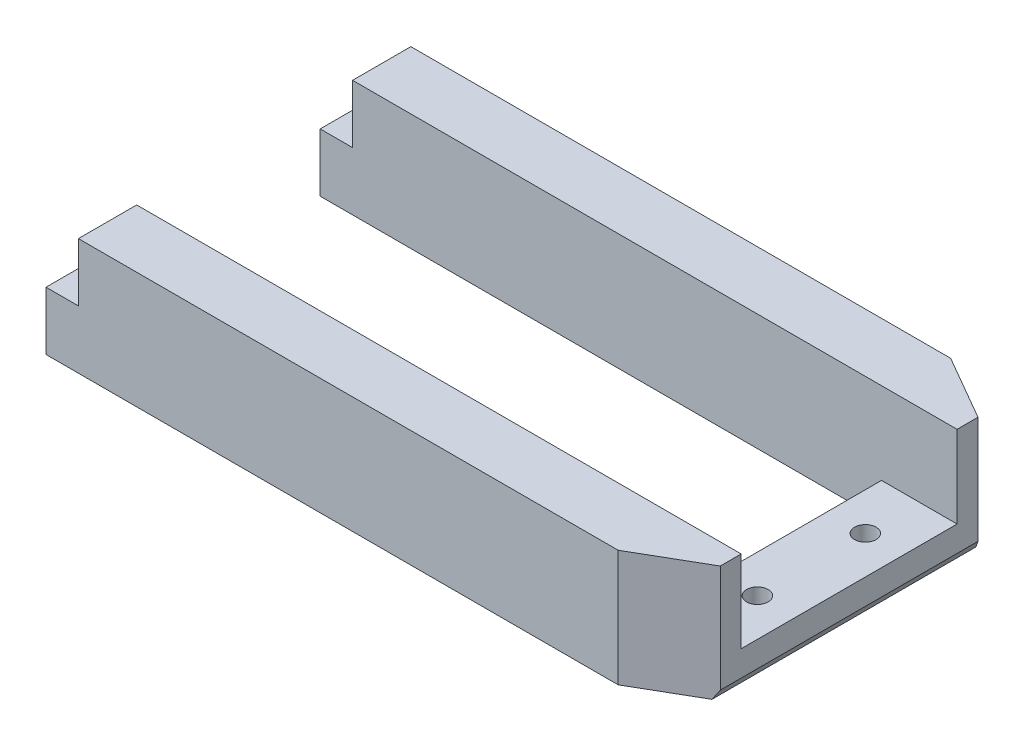
ISO-10303-21;
HEADER;
FILE_DESCRIPTION(('STEP AP214'),'2;1');
FILE_NAME('part.step','',(''),(''),'','','');
FILE_SCHEMA(('AUTOMOTIVE_DESIGN { 1 0 10303 214 1 1 1 1 }'));
ENDSEC;
DATA;
#1=APPLICATION_CONTEXT('core data for automotive mechanical design processes');
#2=APPLICATION_PROTOCOL_DEFINITION('international standard','automotive_design',2000,#1);
#3=PRODUCT_CONTEXT('',#1,'mechanical');
#4=PRODUCT('Part','Part','',(#3));
#5=PRODUCT_RELATED_PRODUCT_CATEGORY('part','',(#4));
#6=PRODUCT_DEFINITION_FORMATION('','',#4);
#7=PRODUCT_DEFINITION_CONTEXT('part definition',#1,'design');
#8=PRODUCT_DEFINITION('design','',#6,#7);
#9=PRODUCT_DEFINITION_SHAPE('','',#8);
#10=(LENGTH_UNIT() NAMED_UNIT(*) SI_UNIT(.MILLI.,.METRE.));
#11=(NAMED_UNIT(*) PLANE_ANGLE_UNIT() SI_UNIT($,.RADIAN.));
#12=(NAMED_UNIT(*) SI_UNIT($,.STERADIAN.) SOLID_ANGLE_UNIT());
#13=UNCERTAINTY_MEASURE_WITH_UNIT(LENGTH_MEASURE(1.E-05),#10,'distance_accuracy_value','');
#14=(GEOMETRIC_REPRESENTATION_CONTEXT(3) GLOBAL_UNCERTAINTY_ASSIGNED_CONTEXT((#13)) GLOBAL_UNIT_ASSIGNED_CONTEXT((#10,
#11,#12)) REPRESENTATION_CONTEXT('',''));
#15=CARTESIAN_POINT('',(0.,0.,0.));
#16=DIRECTION('',(0.,0.,1.));
#17=DIRECTION('',(1.,0.,0.));
#18=AXIS2_PLACEMENT_3D('',#15,#16,#17);
#19=CARTESIAN_POINT('',(-29.0045380195893,13.,-10.8670584657187));
#20=DIRECTION('',(1.,0.,0.));
#21=DIRECTION('',(0.,0.,-1.));
#22=AXIS2_PLACEMENT_3D('',#19,#20,#21);
#23=PLANE('',#22);
#24=DIRECTION('',(0.,-1.,0.));
#25=VECTOR('',#24,1.);
#26=CARTESIAN_POINT('',(-29.0045380195893,13.,-16.2670580842487));
#27=LINE('',#26,#25);
#28=CARTESIAN_POINT('',(-29.0045380195893,7.6,-16.2670580842487));
#29=VERTEX_POINT('',#28);
#30=CARTESIAN_POINT('',(-29.0045380195893,2.2,-16.2670580842487));
#31=VERTEX_POINT('',#30);
#32=EDGE_CURVE('E173',#29,#31,#27,.T.);
#33=ORIENTED_EDGE('',*,*,#32,.T.);
#34=DIRECTION('',(0.,0.,-1.));
#35=VECTOR('',#34,1.);
#36=CARTESIAN_POINT('',(-29.0045380195893,2.2,18.7329419157513));
#37=LINE('',#36,#35);
#38=CARTESIAN_POINT('',(-29.0045380195893,2.2,-10.8670584657187));
#39=VERTEX_POINT('',#38);
#40=EDGE_CURVE('E156',#39,#31,#37,.T.);
#41=ORIENTED_EDGE('',*,*,#40,.F.);
#42=DIRECTION('',(0.,-1.,0.));
#43=VECTOR('',#42,1.);
#44=CARTESIAN_POINT('',(-29.0045380195893,13.,-10.8670584657187));
#45=LINE('',#44,#43);
#46=CARTESIAN_POINT('',(-29.0045380195893,7.6,-10.8670584657187));
#47=VERTEX_POINT('',#46);
#48=EDGE_CURVE('E178',#47,#39,#45,.T.);
#49=ORIENTED_EDGE('',*,*,#48,.F.);
#50=DIRECTION('',(0.,0.,1.));
#51=VECTOR('',#50,1.);
#52=CARTESIAN_POINT('',(-29.0045380195893,7.6,-16.2670580842487));
#53=LINE('',#52,#51);
#54=EDGE_CURVE('E61',#29,#47,#53,.T.);
#55=ORIENTED_EDGE('',*,*,#54,.F.);
#56=EDGE_LOOP('',(#33,#41,#49,#55));
#57=FACE_BOUND('',#56,.T.);
#58=ADVANCED_FACE('F39',(#57),#23,.F.);
#59=CARTESIAN_POINT('',(-29.0045380195893,13.,14.5329411528113));
#60=DIRECTION('',(1.,0.,0.));
#61=DIRECTION('',(0.,0.,-1.));
#62=AXIS2_PLACEMENT_3D('',#59,#60,#61);
#63=PLANE('',#62);
#64=DIRECTION('',(0.,-1.,0.));
#65=VECTOR('',#64,1.);
#66=CARTESIAN_POINT('',(-29.0045380195893,13.,9.13294153428132));
#67=LINE('',#66,#65);
#68=CARTESIAN_POINT('',(-29.0045380195893,7.6,9.13294153428132));
#69=VERTEX_POINT('',#68);
#70=CARTESIAN_POINT('',(-29.0045380195893,2.2,9.13294153428132));
#71=VERTEX_POINT('',#70);
#72=EDGE_CURVE('E307',#69,#71,#67,.T.);
#73=ORIENTED_EDGE('',*,*,#72,.T.);
#74=CARTESIAN_POINT('',(-29.0045380195893,2.2,14.5329411528113));
#75=VERTEX_POINT('',#74);
#76=EDGE_CURVE('E166',#75,#71,#37,.T.);
#77=ORIENTED_EDGE('',*,*,#76,.F.);
#78=DIRECTION('',(0.,-1.,0.));
#79=VECTOR('',#78,1.);
#80=CARTESIAN_POINT('',(-29.0045380195893,13.,14.5329411528113));
#81=LINE('',#80,#79);
#82=CARTESIAN_POINT('',(-29.0045380195893,7.6,14.5329411528113));
#83=VERTEX_POINT('',#82);
#84=EDGE_CURVE('E209',#83,#75,#81,.T.);
#85=ORIENTED_EDGE('',*,*,#84,.F.);
#86=DIRECTION('',(0.,0.,1.));
#87=VECTOR('',#86,1.);
#88=CARTESIAN_POINT('',(-29.0045380195893,7.6,9.13294153428132));
#89=LINE('',#88,#87);
#90=EDGE_CURVE('E260',#69,#83,#89,.T.);
#91=ORIENTED_EDGE('',*,*,#90,.F.);
#92=EDGE_LOOP('',(#73,#77,#85,#91));
#93=FACE_BOUND('',#92,.T.);
#94=ADVANCED_FACE('F340',(#93),#63,.F.);
#95=CARTESIAN_POINT('',(22.9954619804107,13.,9.13294153428132));
#96=DIRECTION('',(1.,0.,0.));
#97=DIRECTION('',(0.,0.,-1.));
#98=AXIS2_PLACEMENT_3D('',#95,#96,#97);
#99=PLANE('',#98);
#100=DIRECTION('',(0.,-1.,0.));
#101=VECTOR('',#100,1.);
#102=CARTESIAN_POINT('',(22.9954619804107,13.,-10.8670584657187));
#103=LINE('',#102,#101);
#104=CARTESIAN_POINT('',(22.9954619804107,5.4,-10.8670584657187));
#105=VERTEX_POINT('',#104);
#106=CARTESIAN_POINT('',(22.9954619804107,2.19999999999999,-10.8670584657187));
#107=VERTEX_POINT('',#106);
#108=EDGE_CURVE('E182',#105,#107,#103,.T.);
#109=ORIENTED_EDGE('',*,*,#108,.T.);
#110=DIRECTION('',(0.,0.,1.));
#111=VECTOR('',#110,1.);
#112=CARTESIAN_POINT('',(22.9954619804107,2.19999999999999,9.13294153428132));
#113=LINE('',#112,#111);
#114=CARTESIAN_POINT('',(22.9954619804107,2.19999999999999,9.13294153428132));
#115=VERTEX_POINT('',#114);
#116=EDGE_CURVE('E224',#107,#115,#113,.T.);
#117=ORIENTED_EDGE('',*,*,#116,.T.);
#118=DIRECTION('',(0.,-1.,0.));
#119=VECTOR('',#118,1.);
#120=CARTESIAN_POINT('',(22.9954619804107,13.,9.13294153428132));
#121=LINE('',#120,#119);
#122=CARTESIAN_POINT('',(22.9954619804107,5.4,9.13294153428132));
#123=VERTEX_POINT('',#122);
#124=EDGE_CURVE('E310',#123,#115,#121,.T.);
#125=ORIENTED_EDGE('',*,*,#124,.F.);
#126=DIRECTION('',(0.,0.,1.));
#127=VECTOR('',#126,1.);
#128=CARTESIAN_POINT('',(22.9954619804107,5.4,-10.8670584657187));
#129=LINE('',#128,#127);
#130=EDGE_CURVE('E258',#105,#123,#129,.T.);
#131=ORIENTED_EDGE('',*,*,#130,.F.);
#132=EDGE_LOOP('',(#109,#117,#125,#131));
#133=FACE_BOUND('',#132,.T.);
#134=ADVANCED_FACE('F316',(#133),#99,.F.);
#135=CARTESIAN_POINT('',(0.,13.,0.));
#136=DIRECTION('',(0.,-1.,0.));
#137=DIRECTION('',(0.,0.,-1.));
#138=AXIS2_PLACEMENT_3D('',#135,#136,#137);
#139=PLANE('',#138);
#140=DIRECTION('',(-1.,0.,0.));
#141=VECTOR('',#140,1.);
#142=CARTESIAN_POINT('',(-29.0045380195893,13.,-16.2670580842487));
#143=LINE('',#142,#141);
#144=CARTESIAN_POINT('',(23.9987941184727,13.,-16.2670580842487));
#145=VERTEX_POINT('',#144);
#146=CARTESIAN_POINT('',(-26.0045380195893,13.,-16.2670580842487));
#147=VERTEX_POINT('',#146);
#148=EDGE_CURVE('E298',#145,#147,#143,.T.);
#149=ORIENTED_EDGE('',*,*,#148,.T.);
#150=DIRECTION('',(0.,0.,-1.));
#151=VECTOR('',#150,1.);
#152=CARTESIAN_POINT('',(-26.0045380195893,13.,-16.2670580842487));
#153=LINE('',#152,#151);
#154=CARTESIAN_POINT('',(-26.0045380195893,13.,-10.8670584657187));
#155=VERTEX_POINT('',#154);
#156=EDGE_CURVE('E245',#155,#147,#153,.T.);
#157=ORIENTED_EDGE('',*,*,#156,.F.);
#158=DIRECTION('',(1.,0.,0.));
#159=VECTOR('',#158,1.);
#160=CARTESIAN_POINT('',(22.9954619804107,13.,-10.8670584657187));
#161=LINE('',#160,#159);
#162=CARTESIAN_POINT('',(29.9954619804107,13.,-10.8670584657187));
#163=VERTEX_POINT('',#162);
#164=EDGE_CURVE('E301',#155,#163,#161,.T.);
#165=ORIENTED_EDGE('',*,*,#164,.T.);
#166=DIRECTION('',(0.,0.,-1.));
#167=VECTOR('',#166,1.);
#168=CARTESIAN_POINT('',(29.9954619804107,13.,-12.8048808076377));
#169=LINE('',#168,#167);
#170=CARTESIAN_POINT('',(29.9954619804107,13.,-12.8048808076377));
#171=VERTEX_POINT('',#170);
#172=EDGE_CURVE('E292',#163,#171,#169,.T.);
#173=ORIENTED_EDGE('',*,*,#172,.T.);
#174=DIRECTION('',(-0.866025436785245,0.,-0.499999942840922));
#175=VECTOR('',#174,1.);
#176=CARTESIAN_POINT('',(23.9987941184727,13.,-16.2670580842487));
#177=LINE('',#176,#175);
#178=EDGE_CURVE('E296',#171,#145,#177,.T.);
#179=ORIENTED_EDGE('',*,*,#178,.T.);
#180=EDGE_LOOP('',(#149,#157,#165,#173,#179));
#181=FACE_BOUND('',#180,.T.);
#182=ADVANCED_FACE('F328',(#181),#139,.F.);
#183=CARTESIAN_POINT('',(23.9987941184727,13.,14.5329411528113));
#184=DIRECTION('',(0.,0.,-1.));
#185=DIRECTION('',(-1.,0.,0.));
#186=AXIS2_PLACEMENT_3D('',#183,#184,#185);
#187=PLANE('',#186);
#188=ORIENTED_EDGE('',*,*,#84,.T.);
#189=DIRECTION('',(1.,0.,0.));
#190=VECTOR('',#189,1.);
#191=CARTESIAN_POINT('',(23.9987941184727,2.19999999999999,14.5329411528113));
#192=LINE('',#191,#190);
#193=CARTESIAN_POINT('',(23.9987941184727,2.19999999999999,14.5329411528113));
#194=VERTEX_POINT('',#193);
#195=EDGE_CURVE('E206',#75,#194,#192,.T.);
#196=ORIENTED_EDGE('',*,*,#195,.T.);
#197=DIRECTION('',(0.,-1.,0.));
#198=VECTOR('',#197,1.);
#199=CARTESIAN_POINT('',(23.9987941184727,13.,14.5329411528113));
#200=LINE('',#199,#198);
#201=CARTESIAN_POINT('',(23.9987941184727,13.,14.5329411528113));
#202=VERTEX_POINT('',#201);
#203=EDGE_CURVE('E47',#202,#194,#200,.T.);
#204=ORIENTED_EDGE('',*,*,#203,.F.);
#205=DIRECTION('',(1.,0.,0.));
#206=VECTOR('',#205,1.);
#207=CARTESIAN_POINT('',(23.9987941184727,13.,14.5329411528113));
#208=LINE('',#207,#206);
#209=CARTESIAN_POINT('',(-26.0045380195893,13.,14.5329411528113));
#210=VERTEX_POINT('',#209);
#211=EDGE_CURVE('E205',#210,#202,#208,.T.);
#212=ORIENTED_EDGE('',*,*,#211,.F.);
#213=DIRECTION('',(0.,1.,0.));
#214=VECTOR('',#213,1.);
#215=CARTESIAN_POINT('',(-26.0045380195893,7.6,14.5329411528113));
#216=LINE('',#215,#214);
#217=CARTESIAN_POINT('',(-26.0045380195893,7.6,14.5329411528113));
#218=VERTEX_POINT('',#217);
#219=EDGE_CURVE('E270',#218,#210,#216,.T.);
#220=ORIENTED_EDGE('',*,*,#219,.F.);
#221=DIRECTION('',(1.,0.,0.));
#222=VECTOR('',#221,1.);
#223=CARTESIAN_POINT('',(-29.0045380195893,7.6,14.5329411528113));
#224=LINE('',#223,#222);
#225=EDGE_CURVE('E262',#83,#218,#224,.T.);
#226=ORIENTED_EDGE('',*,*,#225,.F.);
#227=EDGE_LOOP('',(#188,#196,#204,#212,#220,#226));
#228=FACE_BOUND('',#227,.T.);
#229=ADVANCED_FACE('F41',(#228),#187,.F.);
#230=CARTESIAN_POINT('',(29.9954619804107,13.,11.0707638761913));
#231=DIRECTION('',(-0.499999942841897,0.,-0.866025436784682));
#232=DIRECTION('',(-0.866025436784682,0.,0.499999942841897));
#233=AXIS2_PLACEMENT_3D('',#230,#231,#232);
#234=PLANE('',#233);
#235=ORIENTED_EDGE('',*,*,#203,.T.);
#236=DIRECTION('',(0.866025436784682,0.,-0.499999942841897));
#237=VECTOR('',#236,1.);
#238=CARTESIAN_POINT('',(29.9954619804107,2.19999999999999,11.0707638761913));
#239=LINE('',#238,#237);
#240=CARTESIAN_POINT('',(29.509146190937,2.19999999999999,11.351538385359));
#241=VERTEX_POINT('',#240);
#242=EDGE_CURVE('E196',#194,#241,#239,.T.);
#243=ORIENTED_EDGE('',*,*,#242,.T.);
#244=DIRECTION('',(0.481303277855296,0.831342025386419,-0.277880534676602));
#245=VECTOR('',#244,1.);
#246=CARTESIAN_POINT('',(33.9807332931106,9.92365044920899,8.76986676171679));
#247=LINE('',#246,#245);
#248=CARTESIAN_POINT('',(29.9954619804107,3.04,11.0707638761913));
#249=VERTEX_POINT('',#248);
#250=EDGE_CURVE('E234',#241,#249,#247,.T.);
#251=ORIENTED_EDGE('',*,*,#250,.T.);
#252=DIRECTION('',(0.,-1.,0.));
#253=VECTOR('',#252,1.);
#254=CARTESIAN_POINT('',(29.9954619804107,13.,11.0707638761913));
#255=LINE('',#254,#253);
#256=CARTESIAN_POINT('',(29.9954619804107,13.,11.0707638761913));
#257=VERTEX_POINT('',#256);
#258=EDGE_CURVE('E188',#257,#249,#255,.T.);
#259=ORIENTED_EDGE('',*,*,#258,.F.);
#260=DIRECTION('',(0.866025436784683,0.,-0.499999942841897));
#261=VECTOR('',#260,1.);
#262=CARTESIAN_POINT('',(29.9954619804107,13.,11.0707638761913));
#263=LINE('',#262,#261);
#264=EDGE_CURVE('E199',#202,#257,#263,.T.);
#265=ORIENTED_EDGE('',*,*,#264,.F.);
#266=EDGE_LOOP('',(#235,#243,#251,#259,#265));
#267=FACE_BOUND('',#266,.T.);
#268=ADVANCED_FACE('F195',(#267),#234,.F.);
#269=CARTESIAN_POINT('',(29.9954619804107,13.,-12.8048808076377));
#270=DIRECTION('',(-1.,0.,0.));
#271=DIRECTION('',(0.,0.,1.));
#272=AXIS2_PLACEMENT_3D('',#269,#270,#271);
#273=PLANE('',#272);
#274=ORIENTED_EDGE('',*,*,#258,.T.);
#275=DIRECTION('',(0.,0.,1.));
#276=VECTOR('',#275,1.);
#277=CARTESIAN_POINT('',(29.9954619804107,3.04,-17.8670588471887));
#278=LINE('',#277,#276);
#279=CARTESIAN_POINT('',(29.9954619804107,3.04,-12.8048808076377));
#280=VERTEX_POINT('',#279);
#281=EDGE_CURVE('E228',#280,#249,#278,.T.);
#282=ORIENTED_EDGE('',*,*,#281,.F.);
#283=DIRECTION('',(0.,-1.,0.));
#284=VECTOR('',#283,1.);
#285=CARTESIAN_POINT('',(29.9954619804107,13.,-12.8048808076377));
#286=LINE('',#285,#284);
#287=EDGE_CURVE('E180',#171,#280,#286,.T.);
#288=ORIENTED_EDGE('',*,*,#287,.F.);
#289=ORIENTED_EDGE('',*,*,#172,.F.);
#290=DIRECTION('',(0.,1.,0.));
#291=VECTOR('',#290,1.);
#292=CARTESIAN_POINT('',(29.9954619804107,5.4,-10.8670584657187));
#293=LINE('',#292,#291);
#294=CARTESIAN_POINT('',(29.9954619804107,5.4,-10.8670584657187));
#295=VERTEX_POINT('',#294);
#296=EDGE_CURVE('E285',#295,#163,#293,.T.);
#297=ORIENTED_EDGE('',*,*,#296,.F.);
#298=DIRECTION('',(0.,0.,-1.));
#299=VECTOR('',#298,1.);
#300=CARTESIAN_POINT('',(29.9954619804107,5.4,-10.8670584657187));
#301=LINE('',#300,#299);
#302=CARTESIAN_POINT('',(29.9954619804107,5.4,9.13294153428132));
#303=VERTEX_POINT('',#302);
#304=EDGE_CURVE('E280',#303,#295,#301,.T.);
#305=ORIENTED_EDGE('',*,*,#304,.F.);
#306=DIRECTION('',(0.,1.,0.));
#307=VECTOR('',#306,1.);
#308=CARTESIAN_POINT('',(29.9954619804107,5.4,9.13294153428132));
#309=LINE('',#308,#307);
#310=CARTESIAN_POINT('',(29.9954619804107,13.,9.13294153428132));
#311=VERTEX_POINT('',#310);
#312=EDGE_CURVE('E284',#303,#311,#309,.T.);
#313=ORIENTED_EDGE('',*,*,#312,.T.);
#314=EDGE_CURVE('E293',#257,#311,#169,.T.);
#315=ORIENTED_EDGE('',*,*,#314,.F.);
#316=EDGE_LOOP('',(#274,#282,#288,#289,#297,#305,#313,#315));
#317=FACE_BOUND('',#316,.T.);
#318=ADVANCED_FACE('F351',(#317),#273,.F.);
#319=CARTESIAN_POINT('',(23.9987941184727,13.,-16.2670580842487));
#320=DIRECTION('',(-0.499999942840922,0.,0.866025436785245));
#321=DIRECTION('',(0.866025436785245,0.,0.499999942840922));
#322=AXIS2_PLACEMENT_3D('',#319,#320,#321);
#323=PLANE('',#322);
#324=DIRECTION('',(-0.481303277855392,-0.831342025386586,-0.277880534675935));
#325=VECTOR('',#324,1.);
#326=CARTESIAN_POINT('',(32.1285398710942,6.72440726572613,-11.5733479009645));
#327=LINE('',#326,#325);
#328=CARTESIAN_POINT('',(29.509146190937,2.19999999999999,-13.0856553168046));
#329=VERTEX_POINT('',#328);
#330=EDGE_CURVE('E231',#280,#329,#327,.T.);
#331=ORIENTED_EDGE('',*,*,#330,.T.);
#332=DIRECTION('',(-0.866025436785245,0.,-0.499999942840922));
#333=VECTOR('',#332,1.);
#334=CARTESIAN_POINT('',(23.9987941184727,2.19999999999999,-16.2670580842487));
#335=LINE('',#334,#333);
#336=CARTESIAN_POINT('',(23.9987941184727,2.19999999999999,-16.2670580842487));
#337=VERTEX_POINT('',#336);
#338=EDGE_CURVE('E54',#329,#337,#335,.T.);
#339=ORIENTED_EDGE('',*,*,#338,.T.);
#340=DIRECTION('',(0.,-1.,0.));
#341=VECTOR('',#340,1.);
#342=CARTESIAN_POINT('',(23.9987941184727,13.,-16.2670580842487));
#343=LINE('',#342,#341);
#344=EDGE_CURVE('E176',#145,#337,#343,.T.);
#345=ORIENTED_EDGE('',*,*,#344,.F.);
#346=ORIENTED_EDGE('',*,*,#178,.F.);
#347=ORIENTED_EDGE('',*,*,#287,.T.);
#348=EDGE_LOOP('',(#331,#339,#345,#346,#347));
#349=FACE_BOUND('',#348,.T.);
#350=ADVANCED_FACE('F333',(#349),#323,.F.);
#351=CARTESIAN_POINT('',(-29.0045380195893,13.,-16.2670580842487));
#352=DIRECTION('',(0.,0.,1.));
#353=DIRECTION('',(1.,0.,0.));
#354=AXIS2_PLACEMENT_3D('',#351,#352,#353);
#355=PLANE('',#354);
#356=ORIENTED_EDGE('',*,*,#344,.T.);
#357=DIRECTION('',(1.,0.,0.));
#358=VECTOR('',#357,1.);
#359=CARTESIAN_POINT('',(-29.0045380195893,2.2,-16.2670580842487));
#360=LINE('',#359,#358);
#361=EDGE_CURVE('E159',#31,#337,#360,.T.);
#362=ORIENTED_EDGE('',*,*,#361,.F.);
#363=ORIENTED_EDGE('',*,*,#32,.F.);
#364=DIRECTION('',(-1.,0.,0.));
#365=VECTOR('',#364,1.);
#366=CARTESIAN_POINT('',(-29.0045380195893,7.6,-16.2670580842487));
#367=LINE('',#366,#365);
#368=CARTESIAN_POINT('',(-26.0045380195893,7.6,-16.2670580842487));
#369=VERTEX_POINT('',#368);
#370=EDGE_CURVE('E250',#369,#29,#367,.T.);
#371=ORIENTED_EDGE('',*,*,#370,.F.);
#372=DIRECTION('',(0.,1.,0.));
#373=VECTOR('',#372,1.);
#374=CARTESIAN_POINT('',(-26.0045380195893,7.6,-16.2670580842487));
#375=LINE('',#374,#373);
#376=EDGE_CURVE('E255',#369,#147,#375,.T.);
#377=ORIENTED_EDGE('',*,*,#376,.T.);
#378=ORIENTED_EDGE('',*,*,#148,.F.);
#379=EDGE_LOOP('',(#356,#362,#363,#371,#377,#378));
#380=FACE_BOUND('',#379,.T.);
#381=ADVANCED_FACE('F171',(#380),#355,.F.);
#382=CARTESIAN_POINT('',(22.9954619804107,13.,-10.8670584657187));
#383=DIRECTION('',(0.,0.,-1.));
#384=DIRECTION('',(-1.,0.,0.));
#385=AXIS2_PLACEMENT_3D('',#382,#383,#384);
#386=PLANE('',#385);
#387=ORIENTED_EDGE('',*,*,#48,.T.);
#388=DIRECTION('',(1.,0.,0.));
#389=VECTOR('',#388,1.);
#390=CARTESIAN_POINT('',(22.9954619804107,2.19999999999999,-10.8670584657187));
#391=LINE('',#390,#389);
#392=EDGE_CURVE('E161',#39,#107,#391,.T.);
#393=ORIENTED_EDGE('',*,*,#392,.T.);
#394=ORIENTED_EDGE('',*,*,#108,.F.);
#395=DIRECTION('',(-1.,0.,0.));
#396=VECTOR('',#395,1.);
#397=CARTESIAN_POINT('',(22.9954619804107,5.4,-10.8670584657187));
#398=LINE('',#397,#396);
#399=EDGE_CURVE('E282',#295,#105,#398,.T.);
#400=ORIENTED_EDGE('',*,*,#399,.F.);
#401=ORIENTED_EDGE('',*,*,#296,.T.);
#402=ORIENTED_EDGE('',*,*,#164,.F.);
#403=DIRECTION('',(0.,1.,0.));
#404=VECTOR('',#403,1.);
#405=CARTESIAN_POINT('',(-26.0045380195893,7.6,-10.8670584657187));
#406=LINE('',#405,#404);
#407=CARTESIAN_POINT('',(-26.0045380195893,7.6,-10.8670584657187));
#408=VERTEX_POINT('',#407);
#409=EDGE_CURVE('E252',#408,#155,#406,.T.);
#410=ORIENTED_EDGE('',*,*,#409,.F.);
#411=DIRECTION('',(1.,0.,0.));
#412=VECTOR('',#411,1.);
#413=CARTESIAN_POINT('',(-29.0045380195893,7.6,-10.8670584657187));
#414=LINE('',#413,#412);
#415=EDGE_CURVE('E244',#47,#408,#414,.T.);
#416=ORIENTED_EDGE('',*,*,#415,.F.);
#417=EDGE_LOOP('',(#387,#393,#394,#400,#401,#402,#410,#416));
#418=FACE_BOUND('',#417,.T.);
#419=ADVANCED_FACE('F320',(#418),#386,.F.);
#420=CARTESIAN_POINT('',(-29.0045380195893,13.,9.13294153428132));
#421=DIRECTION('',(0.,0.,1.));
#422=DIRECTION('',(1.,0.,0.));
#423=AXIS2_PLACEMENT_3D('',#420,#421,#422);
#424=PLANE('',#423);
#425=ORIENTED_EDGE('',*,*,#124,.T.);
#426=DIRECTION('',(-1.,0.,0.));
#427=VECTOR('',#426,1.);
#428=CARTESIAN_POINT('',(-29.0045380195893,2.2,9.13294153428132));
#429=LINE('',#428,#427);
#430=EDGE_CURVE('E221',#115,#71,#429,.T.);
#431=ORIENTED_EDGE('',*,*,#430,.T.);
#432=ORIENTED_EDGE('',*,*,#72,.F.);
#433=DIRECTION('',(-1.,0.,0.));
#434=VECTOR('',#433,1.);
#435=CARTESIAN_POINT('',(-29.0045380195893,7.6,9.13294153428132));
#436=LINE('',#435,#434);
#437=CARTESIAN_POINT('',(-26.0045380195893,7.6,9.13294153428132));
#438=VERTEX_POINT('',#437);
#439=EDGE_CURVE('E268',#438,#69,#436,.T.);
#440=ORIENTED_EDGE('',*,*,#439,.F.);
#441=DIRECTION('',(0.,1.,0.));
#442=VECTOR('',#441,1.);
#443=CARTESIAN_POINT('',(-26.0045380195893,7.6,9.13294153428132));
#444=LINE('',#443,#442);
#445=CARTESIAN_POINT('',(-26.0045380195893,13.,9.13294153428132));
#446=VERTEX_POINT('',#445);
#447=EDGE_CURVE('E254',#438,#446,#444,.T.);
#448=ORIENTED_EDGE('',*,*,#447,.T.);
#449=DIRECTION('',(-1.,0.,0.));
#450=VECTOR('',#449,1.);
#451=CARTESIAN_POINT('',(-29.0045380195893,13.,9.13294153428132));
#452=LINE('',#451,#450);
#453=EDGE_CURVE('E303',#311,#446,#452,.T.);
#454=ORIENTED_EDGE('',*,*,#453,.F.);
#455=ORIENTED_EDGE('',*,*,#312,.F.);
#456=DIRECTION('',(1.,0.,0.));
#457=VECTOR('',#456,1.);
#458=CARTESIAN_POINT('',(22.9954619804107,5.4,9.13294153428132));
#459=LINE('',#458,#457);
#460=EDGE_CURVE('E277',#123,#303,#459,.T.);
#461=ORIENTED_EDGE('',*,*,#460,.F.);
#462=EDGE_LOOP('',(#425,#431,#432,#440,#448,#454,#455,#461));
#463=FACE_BOUND('',#462,.T.);
#464=ADVANCED_FACE('F337',(#463),#424,.F.);
#465=ORIENTED_EDGE('',*,*,#453,.T.);
#466=DIRECTION('',(0.,0.,-1.));
#467=VECTOR('',#466,1.);
#468=CARTESIAN_POINT('',(-26.0045380195893,13.,9.13294153428132));
#469=LINE('',#468,#467);
#470=EDGE_CURVE('E240',#210,#446,#469,.T.);
#471=ORIENTED_EDGE('',*,*,#470,.F.);
#472=ORIENTED_EDGE('',*,*,#211,.T.);
#473=ORIENTED_EDGE('',*,*,#264,.T.);
#474=ORIENTED_EDGE('',*,*,#314,.T.);
#475=EDGE_LOOP('',(#465,#471,#472,#473,#474));
#476=FACE_BOUND('',#475,.T.);
#477=ADVANCED_FACE('F347',(#476),#139,.F.);
#478=CARTESIAN_POINT('',(0.,5.4,0.));
#479=DIRECTION('',(0.,1.,0.));
#480=DIRECTION('',(0.,0.,1.));
#481=AXIS2_PLACEMENT_3D('',#478,#479,#480);
#482=PLANE('',#481);
#483=CARTESIAN_POINT('',(26.4954619804107,5.4,-5.86705846571868));
#484=DIRECTION('',(0.,1.,0.));
#485=DIRECTION('',(0.,0.,1.));
#486=AXIS2_PLACEMENT_3D('',#483,#484,#485);
#487=CIRCLE('',#486,1.);
#488=CARTESIAN_POINT('',(26.4954619804107,5.4,-4.86705846571867));
#489=VERTEX_POINT('',#488);
#490=EDGE_CURVE('E237',#489,#489,#487,.T.);
#491=ORIENTED_EDGE('',*,*,#490,.F.);
#492=EDGE_LOOP('',(#491));
#493=FACE_BOUND('',#492,.T.);
#494=CARTESIAN_POINT('',(26.4954619804107,5.4,4.13294153428132));
#495=DIRECTION('',(0.,1.,0.));
#496=DIRECTION('',(0.,0.,1.));
#497=AXIS2_PLACEMENT_3D('',#494,#495,#496);
#498=CIRCLE('',#497,1.);
#499=CARTESIAN_POINT('',(26.4954619804107,5.4,5.13294153428132));
#500=VERTEX_POINT('',#499);
#501=EDGE_CURVE('E236',#500,#500,#498,.T.);
#502=ORIENTED_EDGE('',*,*,#501,.F.);
#503=EDGE_LOOP('',(#502));
#504=FACE_BOUND('',#503,.T.);
#505=ORIENTED_EDGE('',*,*,#130,.T.);
#506=ORIENTED_EDGE('',*,*,#460,.T.);
#507=ORIENTED_EDGE('',*,*,#304,.T.);
#508=ORIENTED_EDGE('',*,*,#399,.T.);
#509=EDGE_LOOP('',(#505,#506,#507,#508));
#510=FACE_BOUND('',#509,.T.);
#511=ADVANCED_FACE('F353',(#493,#504,#510),#482,.T.);
#512=CARTESIAN_POINT('',(-26.0045380195893,7.6,9.13294153428132));
#513=DIRECTION('',(1.,0.,0.));
#514=DIRECTION('',(0.,0.,-1.));
#515=AXIS2_PLACEMENT_3D('',#512,#513,#514);
#516=PLANE('',#515);
#517=ORIENTED_EDGE('',*,*,#470,.T.);
#518=ORIENTED_EDGE('',*,*,#447,.F.);
#519=DIRECTION('',(0.,0.,-1.));
#520=VECTOR('',#519,1.);
#521=CARTESIAN_POINT('',(-26.0045380195893,7.6,9.13294153428132));
#522=LINE('',#521,#520);
#523=EDGE_CURVE('E265',#218,#438,#522,.T.);
#524=ORIENTED_EDGE('',*,*,#523,.F.);
#525=ORIENTED_EDGE('',*,*,#219,.T.);
#526=EDGE_LOOP('',(#517,#518,#524,#525));
#527=FACE_BOUND('',#526,.T.);
#528=ADVANCED_FACE('F345',(#527),#516,.F.);
#529=CARTESIAN_POINT('',(0.,7.6,0.));
#530=DIRECTION('',(0.,1.,0.));
#531=DIRECTION('',(0.,0.,1.));
#532=AXIS2_PLACEMENT_3D('',#529,#530,#531);
#533=PLANE('',#532);
#534=ORIENTED_EDGE('',*,*,#90,.T.);
#535=ORIENTED_EDGE('',*,*,#225,.T.);
#536=ORIENTED_EDGE('',*,*,#523,.T.);
#537=ORIENTED_EDGE('',*,*,#439,.T.);
#538=EDGE_LOOP('',(#534,#535,#536,#537));
#539=FACE_BOUND('',#538,.T.);
#540=ADVANCED_FACE('F342',(#539),#533,.T.);
#541=CARTESIAN_POINT('',(-26.0045380195893,7.6,-16.2670580842487));
#542=DIRECTION('',(1.,0.,0.));
#543=DIRECTION('',(0.,0.,-1.));
#544=AXIS2_PLACEMENT_3D('',#541,#542,#543);
#545=PLANE('',#544);
#546=ORIENTED_EDGE('',*,*,#156,.T.);
#547=ORIENTED_EDGE('',*,*,#376,.F.);
#548=DIRECTION('',(0.,0.,-1.));
#549=VECTOR('',#548,1.);
#550=CARTESIAN_POINT('',(-26.0045380195893,7.6,-16.2670580842487));
#551=LINE('',#550,#549);
#552=EDGE_CURVE('E247',#408,#369,#551,.T.);
#553=ORIENTED_EDGE('',*,*,#552,.F.);
#554=ORIENTED_EDGE('',*,*,#409,.T.);
#555=EDGE_LOOP('',(#546,#547,#553,#554));
#556=FACE_BOUND('',#555,.T.);
#557=ADVANCED_FACE('F436',(#556),#545,.F.);
#558=CARTESIAN_POINT('',(0.,7.6,0.));
#559=DIRECTION('',(0.,1.,0.));
#560=DIRECTION('',(0.,0.,1.));
#561=AXIS2_PLACEMENT_3D('',#558,#559,#560);
#562=PLANE('',#561);
#563=ORIENTED_EDGE('',*,*,#54,.T.);
#564=ORIENTED_EDGE('',*,*,#415,.T.);
#565=ORIENTED_EDGE('',*,*,#552,.T.);
#566=ORIENTED_EDGE('',*,*,#370,.T.);
#567=EDGE_LOOP('',(#563,#564,#565,#566));
#568=FACE_BOUND('',#567,.T.);
#569=ADVANCED_FACE('F324',(#568),#562,.T.);
#570=CARTESIAN_POINT('',(26.4954619804107,-5.,4.13294153428132));
#571=DIRECTION('',(0.,1.,0.));
#572=DIRECTION('',(0.,0.,1.));
#573=AXIS2_PLACEMENT_3D('',#570,#571,#572);
#574=CYLINDRICAL_SURFACE('',#573,1.);
#575=CARTESIAN_POINT('',(26.4954619804107,2.19999999999999,4.13294153428132));
#576=DIRECTION('',(0.,1.,0.));
#577=DIRECTION('',(-1.,0.,0.));
#578=AXIS2_PLACEMENT_3D('',#575,#576,#577);
#579=CIRCLE('',#578,1.);
#580=CARTESIAN_POINT('',(25.4954619804107,2.19999999999999,4.13294153428132));
#581=VERTEX_POINT('',#580);
#582=EDGE_CURVE('E214',#581,#581,#579,.F.);
#583=ORIENTED_EDGE('',*,*,#582,.T.);
#584=EDGE_LOOP('',(#583));
#585=FACE_BOUND('',#584,.T.);
#586=ORIENTED_EDGE('',*,*,#501,.T.);
#587=EDGE_LOOP('',(#586));
#588=FACE_BOUND('',#587,.T.);
#589=ADVANCED_FACE('F435',(#585,#588),#574,.F.);
#590=CARTESIAN_POINT('',(26.4954619804107,-5.,-5.86705846571868));
#591=DIRECTION('',(0.,1.,0.));
#592=DIRECTION('',(0.,0.,1.));
#593=AXIS2_PLACEMENT_3D('',#590,#591,#592);
#594=CYLINDRICAL_SURFACE('',#593,1.);
#595=CARTESIAN_POINT('',(26.4954619804107,2.19999999999999,-5.86705846571868));
#596=DIRECTION('',(0.,1.,0.));
#597=DIRECTION('',(-1.,0.,0.));
#598=AXIS2_PLACEMENT_3D('',#595,#596,#597);
#599=CIRCLE('',#598,1.);
#600=CARTESIAN_POINT('',(25.4954619804107,2.19999999999999,-5.86705846571868));
#601=VERTEX_POINT('',#600);
#602=EDGE_CURVE('E211',#601,#601,#599,.F.);
#603=ORIENTED_EDGE('',*,*,#602,.T.);
#604=EDGE_LOOP('',(#603));
#605=FACE_BOUND('',#604,.T.);
#606=ORIENTED_EDGE('',*,*,#490,.T.);
#607=EDGE_LOOP('',(#606));
#608=FACE_BOUND('',#607,.T.);
#609=ADVANCED_FACE('F503',(#605,#608),#594,.F.);
#610=CARTESIAN_POINT('',(28.2354619804107,0.,-17.8670588471887));
#611=DIRECTION('',(-0.865426285481126,0.501036270541705,0.));
#612=DIRECTION('',(-0.501036270541705,-0.865426285481126,0.));
#613=AXIS2_PLACEMENT_3D('',#610,#611,#612);
#614=PLANE('',#613);
#615=ORIENTED_EDGE('',*,*,#250,.F.);
#616=DIRECTION('',(0.,0.,-1.));
#617=VECTOR('',#616,1.);
#618=CARTESIAN_POINT('',(29.509146190937,2.19999999999999,-17.8670588471887));
#619=LINE('',#618,#617);
#620=EDGE_CURVE('E11',#241,#329,#619,.T.);
#621=ORIENTED_EDGE('',*,*,#620,.T.);
#622=ORIENTED_EDGE('',*,*,#330,.F.);
#623=ORIENTED_EDGE('',*,*,#281,.T.);
#624=EDGE_LOOP('',(#615,#621,#622,#623));
#625=FACE_BOUND('',#624,.T.);
#626=ADVANCED_FACE('F507',(#625),#614,.F.);
#627=CARTESIAN_POINT('',(-29.0045380195893,2.2,18.7329419157513));
#628=DIRECTION('',(0.,1.,0.));
#629=DIRECTION('',(-1.,0.,0.));
#630=AXIS2_PLACEMENT_3D('',#627,#628,#629);
#631=PLANE('',#630);
#632=ORIENTED_EDGE('',*,*,#602,.F.);
#633=EDGE_LOOP('',(#632));
#634=FACE_BOUND('',#633,.T.);
#635=ORIENTED_EDGE('',*,*,#582,.F.);
#636=EDGE_LOOP('',(#635));
#637=FACE_BOUND('',#636,.T.);
#638=ORIENTED_EDGE('',*,*,#40,.T.);
#639=ORIENTED_EDGE('',*,*,#361,.T.);
#640=ORIENTED_EDGE('',*,*,#338,.F.);
#641=ORIENTED_EDGE('',*,*,#620,.F.);
#642=ORIENTED_EDGE('',*,*,#242,.F.);
#643=ORIENTED_EDGE('',*,*,#195,.F.);
#644=ORIENTED_EDGE('',*,*,#76,.T.);
#645=ORIENTED_EDGE('',*,*,#430,.F.);
#646=ORIENTED_EDGE('',*,*,#116,.F.);
#647=ORIENTED_EDGE('',*,*,#392,.F.);
#648=EDGE_LOOP('',(#638,#639,#640,#641,#642,#643,#644,#645,#646,#647));
#649=FACE_BOUND('',#648,.T.);
#650=ADVANCED_FACE('F158',(#634,#637,#649),#631,.F.);
#651=CLOSED_SHELL('',(#58,#94,#134,#182,#229,#268,#318,#350,#381,#419,#464,#477,#511,#528,#540,
#557,#569,#589,#609,#626,#650));
#652=MANIFOLD_SOLID_BREP('B2',#651);
#653=ADVANCED_BREP_SHAPE_REPRESENTATION('',(#18,#652),#14);
#654=SHAPE_DEFINITION_REPRESENTATION(#9,#653);
ENDSEC;
END-ISO-10303-21;
